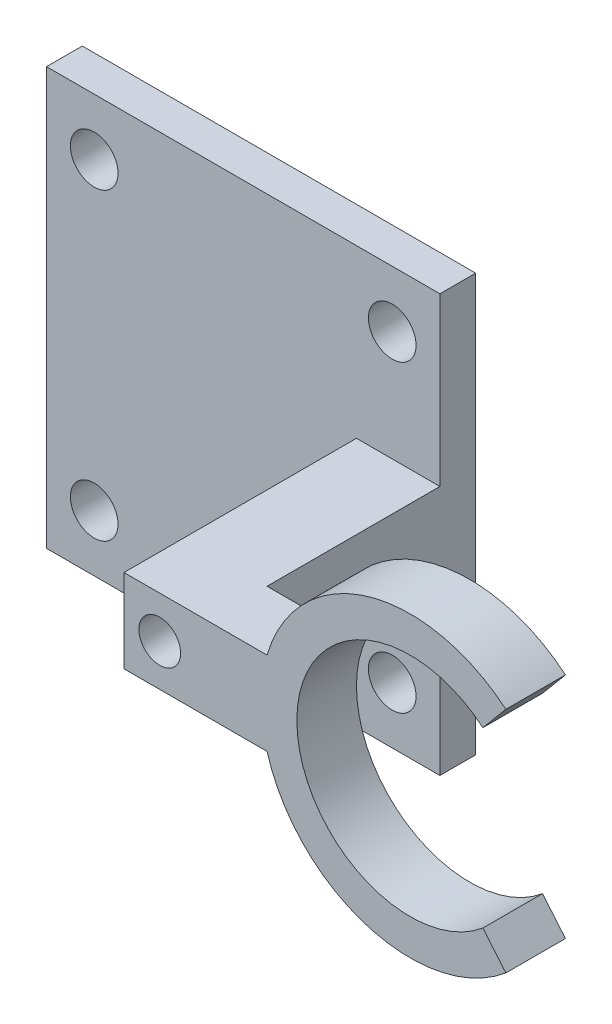
ISO-10303-21;
HEADER;
FILE_DESCRIPTION(('STEP AP214'),'2;1');
FILE_NAME('part.step','',(''),(''),'','','');
FILE_SCHEMA(('AUTOMOTIVE_DESIGN { 1 0 10303 214 1 1 1 1 }'));
ENDSEC;
DATA;
#1=APPLICATION_CONTEXT('core data for automotive mechanical design processes');
#2=APPLICATION_PROTOCOL_DEFINITION('international standard','automotive_design',2000,#1);
#3=PRODUCT_CONTEXT('',#1,'mechanical');
#4=PRODUCT('Part','Part','',(#3));
#5=PRODUCT_RELATED_PRODUCT_CATEGORY('part','',(#4));
#6=PRODUCT_DEFINITION_FORMATION('','',#4);
#7=PRODUCT_DEFINITION_CONTEXT('part definition',#1,'design');
#8=PRODUCT_DEFINITION('design','',#6,#7);
#9=PRODUCT_DEFINITION_SHAPE('','',#8);
#10=(LENGTH_UNIT() NAMED_UNIT(*) SI_UNIT(.MILLI.,.METRE.));
#11=(NAMED_UNIT(*) PLANE_ANGLE_UNIT() SI_UNIT($,.RADIAN.));
#12=(NAMED_UNIT(*) SI_UNIT($,.STERADIAN.) SOLID_ANGLE_UNIT());
#13=UNCERTAINTY_MEASURE_WITH_UNIT(LENGTH_MEASURE(1.E-05),#10,'distance_accuracy_value','');
#14=(GEOMETRIC_REPRESENTATION_CONTEXT(3) GLOBAL_UNCERTAINTY_ASSIGNED_CONTEXT((#13)) GLOBAL_UNIT_ASSIGNED_CONTEXT((#10,
#11,#12)) REPRESENTATION_CONTEXT('',''));
#15=CARTESIAN_POINT('',(0.,0.,0.));
#16=DIRECTION('',(0.,0.,1.));
#17=DIRECTION('',(1.,0.,0.));
#18=AXIS2_PLACEMENT_3D('',#15,#16,#17);
#19=CARTESIAN_POINT('',(0.,3.5,0.));
#20=DIRECTION('',(0.,-1.,0.));
#21=DIRECTION('',(0.,0.,-1.));
#22=AXIS2_PLACEMENT_3D('',#19,#20,#21);
#23=PLANE('',#22);
#24=DIRECTION('',(1.,0.,0.));
#25=VECTOR('',#24,1.);
#26=CARTESIAN_POINT('',(0.,3.5,-17.));
#27=LINE('',#26,#25);
#28=CARTESIAN_POINT('',(-24.,3.5,-17.));
#29=VERTEX_POINT('',#28);
#30=CARTESIAN_POINT('',(-17.,3.5,-17.));
#31=VERTEX_POINT('',#30);
#32=EDGE_CURVE('E233',#29,#31,#27,.T.);
#33=ORIENTED_EDGE('',*,*,#32,.F.);
#34=DIRECTION('',(0.,0.,1.));
#35=VECTOR('',#34,1.);
#36=CARTESIAN_POINT('',(-24.,3.5,2.5));
#37=LINE('',#36,#35);
#38=CARTESIAN_POINT('',(-24.,3.5,2.5));
#39=VERTEX_POINT('',#38);
#40=EDGE_CURVE('E58',#29,#39,#37,.T.);
#41=ORIENTED_EDGE('',*,*,#40,.T.);
#42=DIRECTION('',(1.,0.,0.));
#43=VECTOR('',#42,1.);
#44=CARTESIAN_POINT('',(-12.,3.5,2.5));
#45=LINE('',#44,#43);
#46=CARTESIAN_POINT('',(-12.,3.5,2.5));
#47=VERTEX_POINT('',#46);
#48=EDGE_CURVE('E252',#39,#47,#45,.T.);
#49=ORIENTED_EDGE('',*,*,#48,.T.);
#50=DIRECTION('',(0.,0.,-1.));
#51=VECTOR('',#50,1.);
#52=CARTESIAN_POINT('',(-12.,3.5,-2.5));
#53=LINE('',#52,#51);
#54=CARTESIAN_POINT('',(-12.,3.50000000000001,-2.5));
#55=VERTEX_POINT('',#54);
#56=EDGE_CURVE('E245',#47,#55,#53,.T.);
#57=ORIENTED_EDGE('',*,*,#56,.T.);
#58=DIRECTION('',(-1.,0.,0.));
#59=VECTOR('',#58,1.);
#60=CARTESIAN_POINT('',(-12.,3.5,-2.5));
#61=LINE('',#60,#59);
#62=CARTESIAN_POINT('',(-17.,3.5,-2.5));
#63=VERTEX_POINT('',#62);
#64=EDGE_CURVE('E81',#55,#63,#61,.T.);
#65=ORIENTED_EDGE('',*,*,#64,.T.);
#66=DIRECTION('',(0.,0.,-1.));
#67=VECTOR('',#66,1.);
#68=CARTESIAN_POINT('',(-17.,3.5,-2.5));
#69=LINE('',#68,#67);
#70=EDGE_CURVE('E249',#63,#31,#69,.T.);
#71=ORIENTED_EDGE('',*,*,#70,.T.);
#72=EDGE_LOOP('',(#33,#41,#49,#57,#65,#71));
#73=FACE_BOUND('',#72,.T.);
#74=ADVANCED_FACE('F35',(#73),#23,.F.);
#75=CARTESIAN_POINT('',(0.,-3.5,0.));
#76=DIRECTION('',(0.,-1.,0.));
#77=DIRECTION('',(0.,0.,-1.));
#78=AXIS2_PLACEMENT_3D('',#75,#76,#77);
#79=PLANE('',#78);
#80=DIRECTION('',(0.,0.,1.));
#81=VECTOR('',#80,1.);
#82=CARTESIAN_POINT('',(-24.,-3.5,2.5));
#83=LINE('',#82,#81);
#84=CARTESIAN_POINT('',(-24.,-3.5,-17.));
#85=VERTEX_POINT('',#84);
#86=CARTESIAN_POINT('',(-24.,-3.5,2.5));
#87=VERTEX_POINT('',#86);
#88=EDGE_CURVE('E75',#85,#87,#83,.T.);
#89=ORIENTED_EDGE('',*,*,#88,.F.);
#90=DIRECTION('',(1.,0.,0.));
#91=VECTOR('',#90,1.);
#92=CARTESIAN_POINT('',(0.,-3.5,-17.));
#93=LINE('',#92,#91);
#94=CARTESIAN_POINT('',(-17.,-3.5,-17.));
#95=VERTEX_POINT('',#94);
#96=EDGE_CURVE('E11',#85,#95,#93,.T.);
#97=ORIENTED_EDGE('',*,*,#96,.T.);
#98=DIRECTION('',(0.,0.,-1.));
#99=VECTOR('',#98,1.);
#100=CARTESIAN_POINT('',(-17.,-3.5,-2.5));
#101=LINE('',#100,#99);
#102=CARTESIAN_POINT('',(-17.,-3.5,-2.5));
#103=VERTEX_POINT('',#102);
#104=EDGE_CURVE('E259',#103,#95,#101,.T.);
#105=ORIENTED_EDGE('',*,*,#104,.F.);
#106=DIRECTION('',(-1.,0.,0.));
#107=VECTOR('',#106,1.);
#108=CARTESIAN_POINT('',(-12.,-3.5,-2.5));
#109=LINE('',#108,#107);
#110=CARTESIAN_POINT('',(-12.,-3.5,-2.5));
#111=VERTEX_POINT('',#110);
#112=EDGE_CURVE('E257',#111,#103,#109,.T.);
#113=ORIENTED_EDGE('',*,*,#112,.F.);
#114=DIRECTION('',(0.,0.,-1.));
#115=VECTOR('',#114,1.);
#116=CARTESIAN_POINT('',(-12.,-3.5,-2.5));
#117=LINE('',#116,#115);
#118=CARTESIAN_POINT('',(-12.,-3.5,2.5));
#119=VERTEX_POINT('',#118);
#120=EDGE_CURVE('E244',#119,#111,#117,.T.);
#121=ORIENTED_EDGE('',*,*,#120,.F.);
#122=DIRECTION('',(1.,0.,0.));
#123=VECTOR('',#122,1.);
#124=CARTESIAN_POINT('',(-12.,-3.5,2.5));
#125=LINE('',#124,#123);
#126=EDGE_CURVE('E247',#87,#119,#125,.T.);
#127=ORIENTED_EDGE('',*,*,#126,.F.);
#128=EDGE_LOOP('',(#89,#97,#105,#113,#121,#127));
#129=FACE_BOUND('',#128,.T.);
#130=ADVANCED_FACE('F281',(#129),#79,.T.);
#131=CARTESIAN_POINT('',(-12.,3.5,-2.5));
#132=DIRECTION('',(0.,0.,1.));
#133=DIRECTION('',(1.,0.,0.));
#134=AXIS2_PLACEMENT_3D('',#131,#132,#133);
#135=PLANE('',#134);
#136=ORIENTED_EDGE('',*,*,#64,.F.);
#137=CARTESIAN_POINT('',(0.,0.,-2.5));
#138=DIRECTION('',(0.,0.,1.));
#139=DIRECTION('',(0.642787609686539,0.766044443118978,0.));
#140=AXIS2_PLACEMENT_3D('',#137,#138,#139);
#141=CIRCLE('',#140,12.5);
#142=CARTESIAN_POINT('',(8.03484512108174,9.57555553898723,-2.5));
#143=VERTEX_POINT('',#142);
#144=EDGE_CURVE('E149',#143,#55,#141,.T.);
#145=ORIENTED_EDGE('',*,*,#144,.F.);
#146=DIRECTION('',(0.642787609686539,0.766044443118979,0.));
#147=VECTOR('',#146,1.);
#148=CARTESIAN_POINT('',(6.10648229202213,7.27742220963029,-2.5));
#149=LINE('',#148,#147);
#150=CARTESIAN_POINT('',(6.10648229202213,7.27742220963029,-2.5));
#151=VERTEX_POINT('',#150);
#152=EDGE_CURVE('E157',#151,#143,#149,.T.);
#153=ORIENTED_EDGE('',*,*,#152,.F.);
#154=CARTESIAN_POINT('',(0.,0.,-2.5));
#155=DIRECTION('',(0.,0.,1.));
#156=DIRECTION('',(0.642787609686539,0.766044443118978,0.));
#157=AXIS2_PLACEMENT_3D('',#154,#155,#156);
#158=CIRCLE('',#157,9.5);
#159=CARTESIAN_POINT('',(6.10648229202215,-7.27742220963027,-2.5));
#160=VERTEX_POINT('',#159);
#161=EDGE_CURVE('E181',#151,#160,#158,.T.);
#162=ORIENTED_EDGE('',*,*,#161,.T.);
#163=DIRECTION('',(0.642787609686543,-0.766044443118975,0.));
#164=VECTOR('',#163,1.);
#165=CARTESIAN_POINT('',(6.10648229202215,-7.27742220963027,-2.5));
#166=LINE('',#165,#164);
#167=CARTESIAN_POINT('',(8.03484512108177,-9.5755555389872,-2.5));
#168=VERTEX_POINT('',#167);
#169=EDGE_CURVE('E182',#160,#168,#166,.T.);
#170=ORIENTED_EDGE('',*,*,#169,.T.);
#171=EDGE_CURVE('E163',#111,#168,#141,.T.);
#172=ORIENTED_EDGE('',*,*,#171,.F.);
#173=ORIENTED_EDGE('',*,*,#112,.T.);
#174=DIRECTION('',(0.,-1.,0.));
#175=VECTOR('',#174,1.);
#176=CARTESIAN_POINT('',(-17.,3.5,-2.5));
#177=LINE('',#176,#175);
#178=EDGE_CURVE('E43',#63,#103,#177,.T.);
#179=ORIENTED_EDGE('',*,*,#178,.F.);
#180=EDGE_LOOP('',(#136,#145,#153,#162,#170,#172,#173,#179));
#181=FACE_BOUND('',#180,.T.);
#182=ADVANCED_FACE('F37',(#181),#135,.F.);
#183=CARTESIAN_POINT('',(-17.,3.5,-2.5));
#184=DIRECTION('',(-1.,0.,0.));
#185=DIRECTION('',(0.,0.,1.));
#186=AXIS2_PLACEMENT_3D('',#183,#184,#185);
#187=PLANE('',#186);
#188=DIRECTION('',(0.,-1.,0.));
#189=VECTOR('',#188,1.);
#190=CARTESIAN_POINT('',(-17.,3.5,-20.));
#191=LINE('',#190,#189);
#192=CARTESIAN_POINT('',(-17.,17.5,-20.));
#193=VERTEX_POINT('',#192);
#194=CARTESIAN_POINT('',(-17.,-17.5,-20.));
#195=VERTEX_POINT('',#194);
#196=EDGE_CURVE('E272',#193,#195,#191,.T.);
#197=ORIENTED_EDGE('',*,*,#196,.F.);
#198=DIRECTION('',(0.,0.,-1.));
#199=VECTOR('',#198,1.);
#200=CARTESIAN_POINT('',(-17.,17.5,31.1040538832228));
#201=LINE('',#200,#199);
#202=CARTESIAN_POINT('',(-17.,17.5,-17.));
#203=VERTEX_POINT('',#202);
#204=EDGE_CURVE('E215',#203,#193,#201,.T.);
#205=ORIENTED_EDGE('',*,*,#204,.F.);
#206=DIRECTION('',(0.,1.,0.));
#207=VECTOR('',#206,1.);
#208=CARTESIAN_POINT('',(-17.,0.,-17.));
#209=LINE('',#208,#207);
#210=EDGE_CURVE('E236',#31,#203,#209,.T.);
#211=ORIENTED_EDGE('',*,*,#210,.F.);
#212=ORIENTED_EDGE('',*,*,#70,.F.);
#213=ORIENTED_EDGE('',*,*,#178,.T.);
#214=ORIENTED_EDGE('',*,*,#104,.T.);
#215=CARTESIAN_POINT('',(-17.,-17.5,-17.));
#216=VERTEX_POINT('',#215);
#217=EDGE_CURVE('E50',#216,#95,#209,.T.);
#218=ORIENTED_EDGE('',*,*,#217,.F.);
#219=DIRECTION('',(0.,0.,-1.));
#220=VECTOR('',#219,1.);
#221=CARTESIAN_POINT('',(-17.,-17.5,31.1040538832228));
#222=LINE('',#221,#220);
#223=EDGE_CURVE('E218',#216,#195,#222,.T.);
#224=ORIENTED_EDGE('',*,*,#223,.T.);
#225=EDGE_LOOP('',(#197,#205,#211,#212,#213,#214,#218,#224));
#226=FACE_BOUND('',#225,.T.);
#227=ADVANCED_FACE('F277',(#226),#187,.F.);
#228=CARTESIAN_POINT('',(-50.,3.5,-20.));
#229=DIRECTION('',(0.,0.,1.));
#230=DIRECTION('',(1.,0.,0.));
#231=AXIS2_PLACEMENT_3D('',#228,#229,#230);
#232=PLANE('',#231);
#233=CARTESIAN_POINT('',(-21.,0.,-20.));
#234=DIRECTION('',(0.,0.,1.));
#235=DIRECTION('',(1.,0.,0.));
#236=AXIS2_PLACEMENT_3D('',#233,#234,#235);
#237=CIRCLE('',#236,1.75);
#238=CARTESIAN_POINT('',(-19.25,0.,-20.));
#239=VERTEX_POINT('',#238);
#240=EDGE_CURVE('E187',#239,#239,#237,.T.);
#241=ORIENTED_EDGE('',*,*,#240,.T.);
#242=EDGE_LOOP('',(#241));
#243=FACE_BOUND('',#242,.T.);
#244=ORIENTED_EDGE('',*,*,#196,.T.);
#245=DIRECTION('',(-1.,0.,0.));
#246=VECTOR('',#245,1.);
#247=CARTESIAN_POINT('',(0.,-17.5,-20.));
#248=LINE('',#247,#246);
#249=CARTESIAN_POINT('',(-50.,-17.5,-20.));
#250=VERTEX_POINT('',#249);
#251=EDGE_CURVE('E205',#195,#250,#248,.T.);
#252=ORIENTED_EDGE('',*,*,#251,.T.);
#253=DIRECTION('',(0.,-1.,0.));
#254=VECTOR('',#253,1.);
#255=CARTESIAN_POINT('',(-50.,3.5,-20.));
#256=LINE('',#255,#254);
#257=CARTESIAN_POINT('',(-50.,17.5,-20.));
#258=VERTEX_POINT('',#257);
#259=EDGE_CURVE('E270',#258,#250,#256,.T.);
#260=ORIENTED_EDGE('',*,*,#259,.F.);
#261=DIRECTION('',(-1.,0.,0.));
#262=VECTOR('',#261,1.);
#263=CARTESIAN_POINT('',(0.,17.5,-20.));
#264=LINE('',#263,#262);
#265=EDGE_CURVE('E212',#193,#258,#264,.T.);
#266=ORIENTED_EDGE('',*,*,#265,.F.);
#267=EDGE_LOOP('',(#244,#252,#260,#266));
#268=FACE_BOUND('',#267,.T.);
#269=CARTESIAN_POINT('',(-21.,-12.75,-20.));
#270=DIRECTION('',(0.,0.,-1.));
#271=DIRECTION('',(-1.,0.,0.));
#272=AXIS2_PLACEMENT_3D('',#269,#270,#271);
#273=CIRCLE('',#272,2.);
#274=CARTESIAN_POINT('',(-23.,-12.75,-20.));
#275=VERTEX_POINT('',#274);
#276=EDGE_CURVE('E206',#275,#275,#273,.T.);
#277=ORIENTED_EDGE('',*,*,#276,.F.);
#278=EDGE_LOOP('',(#277));
#279=FACE_BOUND('',#278,.T.);
#280=CARTESIAN_POINT('',(-46.,-12.75,-20.));
#281=DIRECTION('',(0.,0.,-1.));
#282=DIRECTION('',(-1.,0.,0.));
#283=AXIS2_PLACEMENT_3D('',#280,#281,#282);
#284=CIRCLE('',#283,2.);
#285=CARTESIAN_POINT('',(-48.,-12.75,-20.));
#286=VERTEX_POINT('',#285);
#287=EDGE_CURVE('E197',#286,#286,#284,.F.);
#288=ORIENTED_EDGE('',*,*,#287,.T.);
#289=EDGE_LOOP('',(#288));
#290=FACE_BOUND('',#289,.T.);
#291=CARTESIAN_POINT('',(-21.,12.75,-20.));
#292=DIRECTION('',(0.,0.,-1.));
#293=DIRECTION('',(-1.,0.,0.));
#294=AXIS2_PLACEMENT_3D('',#291,#292,#293);
#295=CIRCLE('',#294,2.);
#296=CARTESIAN_POINT('',(-23.,12.75,-20.));
#297=VERTEX_POINT('',#296);
#298=EDGE_CURVE('E198',#297,#297,#295,.T.);
#299=ORIENTED_EDGE('',*,*,#298,.F.);
#300=EDGE_LOOP('',(#299));
#301=FACE_BOUND('',#300,.T.);
#302=CARTESIAN_POINT('',(-46.,12.75,-20.));
#303=DIRECTION('',(0.,0.,-1.));
#304=DIRECTION('',(-1.,0.,0.));
#305=AXIS2_PLACEMENT_3D('',#302,#303,#304);
#306=CIRCLE('',#305,2.);
#307=CARTESIAN_POINT('',(-48.,12.75,-20.));
#308=VERTEX_POINT('',#307);
#309=EDGE_CURVE('E193',#308,#308,#306,.F.);
#310=ORIENTED_EDGE('',*,*,#309,.T.);
#311=EDGE_LOOP('',(#310));
#312=FACE_BOUND('',#311,.T.);
#313=ADVANCED_FACE('F312',(#243,#268,#279,#290,#301,#312),#232,.F.);
#314=CARTESIAN_POINT('',(-50.,3.5,-17.));
#315=DIRECTION('',(1.,0.,0.));
#316=DIRECTION('',(0.,0.,-1.));
#317=AXIS2_PLACEMENT_3D('',#314,#315,#316);
#318=PLANE('',#317);
#319=ORIENTED_EDGE('',*,*,#259,.T.);
#320=DIRECTION('',(0.,0.,-1.));
#321=VECTOR('',#320,1.);
#322=CARTESIAN_POINT('',(-50.,-17.5,31.1040538832228));
#323=LINE('',#322,#321);
#324=CARTESIAN_POINT('',(-50.,-17.5,-17.));
#325=VERTEX_POINT('',#324);
#326=EDGE_CURVE('E221',#325,#250,#323,.T.);
#327=ORIENTED_EDGE('',*,*,#326,.F.);
#328=DIRECTION('',(0.,-1.,0.));
#329=VECTOR('',#328,1.);
#330=CARTESIAN_POINT('',(-50.,3.5,-17.));
#331=LINE('',#330,#329);
#332=CARTESIAN_POINT('',(-50.,17.5,-17.));
#333=VERTEX_POINT('',#332);
#334=EDGE_CURVE('E268',#333,#325,#331,.T.);
#335=ORIENTED_EDGE('',*,*,#334,.F.);
#336=DIRECTION('',(0.,0.,-1.));
#337=VECTOR('',#336,1.);
#338=CARTESIAN_POINT('',(-50.,17.5,31.1040538832228));
#339=LINE('',#338,#337);
#340=EDGE_CURVE('E190',#333,#258,#339,.T.);
#341=ORIENTED_EDGE('',*,*,#340,.T.);
#342=EDGE_LOOP('',(#319,#327,#335,#341));
#343=FACE_BOUND('',#342,.T.);
#344=ADVANCED_FACE('F309',(#343),#318,.F.);
#345=CARTESIAN_POINT('',(-24.,3.5,-17.));
#346=DIRECTION('',(0.,0.,-1.));
#347=DIRECTION('',(-1.,0.,0.));
#348=AXIS2_PLACEMENT_3D('',#345,#346,#347);
#349=PLANE('',#348);
#350=ORIENTED_EDGE('',*,*,#334,.T.);
#351=DIRECTION('',(1.,0.,0.));
#352=VECTOR('',#351,1.);
#353=CARTESIAN_POINT('',(0.,-17.5,-17.));
#354=LINE('',#353,#352);
#355=EDGE_CURVE('E234',#325,#216,#354,.T.);
#356=ORIENTED_EDGE('',*,*,#355,.T.);
#357=ORIENTED_EDGE('',*,*,#217,.T.);
#358=ORIENTED_EDGE('',*,*,#96,.F.);
#359=DIRECTION('',(0.,-1.,0.));
#360=VECTOR('',#359,1.);
#361=CARTESIAN_POINT('',(-24.,3.5,-17.));
#362=LINE('',#361,#360);
#363=EDGE_CURVE('E266',#29,#85,#362,.T.);
#364=ORIENTED_EDGE('',*,*,#363,.F.);
#365=ORIENTED_EDGE('',*,*,#32,.T.);
#366=ORIENTED_EDGE('',*,*,#210,.T.);
#367=DIRECTION('',(1.,0.,0.));
#368=VECTOR('',#367,1.);
#369=CARTESIAN_POINT('',(0.,17.5,-17.));
#370=LINE('',#369,#368);
#371=EDGE_CURVE('E209',#333,#203,#370,.T.);
#372=ORIENTED_EDGE('',*,*,#371,.F.);
#373=EDGE_LOOP('',(#350,#356,#357,#358,#364,#365,#366,#372));
#374=FACE_BOUND('',#373,.T.);
#375=CARTESIAN_POINT('',(-21.,-12.75,-17.));
#376=DIRECTION('',(0.,0.,-1.));
#377=DIRECTION('',(-1.,0.,0.));
#378=AXIS2_PLACEMENT_3D('',#375,#376,#377);
#379=CIRCLE('',#378,2.);
#380=CARTESIAN_POINT('',(-23.,-12.75,-17.));
#381=VERTEX_POINT('',#380);
#382=EDGE_CURVE('E201',#381,#381,#379,.F.);
#383=ORIENTED_EDGE('',*,*,#382,.F.);
#384=EDGE_LOOP('',(#383));
#385=FACE_BOUND('',#384,.T.);
#386=CARTESIAN_POINT('',(-46.,-12.75,-17.));
#387=DIRECTION('',(0.,0.,-1.));
#388=DIRECTION('',(-1.,0.,0.));
#389=AXIS2_PLACEMENT_3D('',#386,#387,#388);
#390=CIRCLE('',#389,2.);
#391=CARTESIAN_POINT('',(-48.,-12.75,-17.));
#392=VERTEX_POINT('',#391);
#393=EDGE_CURVE('E230',#392,#392,#390,.T.);
#394=ORIENTED_EDGE('',*,*,#393,.T.);
#395=EDGE_LOOP('',(#394));
#396=FACE_BOUND('',#395,.T.);
#397=CARTESIAN_POINT('',(-21.,12.75,-17.));
#398=DIRECTION('',(0.,0.,-1.));
#399=DIRECTION('',(-1.,0.,0.));
#400=AXIS2_PLACEMENT_3D('',#397,#398,#399);
#401=CIRCLE('',#400,2.);
#402=CARTESIAN_POINT('',(-23.,12.75,-17.));
#403=VERTEX_POINT('',#402);
#404=EDGE_CURVE('E202',#403,#403,#401,.F.);
#405=ORIENTED_EDGE('',*,*,#404,.F.);
#406=EDGE_LOOP('',(#405));
#407=FACE_BOUND('',#406,.T.);
#408=CARTESIAN_POINT('',(-46.,12.75,-17.));
#409=DIRECTION('',(0.,0.,-1.));
#410=DIRECTION('',(-1.,0.,0.));
#411=AXIS2_PLACEMENT_3D('',#408,#409,#410);
#412=CIRCLE('',#411,2.);
#413=CARTESIAN_POINT('',(-48.,12.75,-17.));
#414=VERTEX_POINT('',#413);
#415=EDGE_CURVE('E196',#414,#414,#412,.T.);
#416=ORIENTED_EDGE('',*,*,#415,.T.);
#417=EDGE_LOOP('',(#416));
#418=FACE_BOUND('',#417,.T.);
#419=ADVANCED_FACE('F285',(#374,#385,#396,#407,#418),#349,.F.);
#420=CARTESIAN_POINT('',(-24.,3.5,2.5));
#421=DIRECTION('',(1.,0.,0.));
#422=DIRECTION('',(0.,0.,-1.));
#423=AXIS2_PLACEMENT_3D('',#420,#421,#422);
#424=PLANE('',#423);
#425=ORIENTED_EDGE('',*,*,#88,.T.);
#426=DIRECTION('',(0.,-1.,0.));
#427=VECTOR('',#426,1.);
#428=CARTESIAN_POINT('',(-24.,3.5,2.5));
#429=LINE('',#428,#427);
#430=EDGE_CURVE('E254',#39,#87,#429,.T.);
#431=ORIENTED_EDGE('',*,*,#430,.F.);
#432=ORIENTED_EDGE('',*,*,#40,.F.);
#433=ORIENTED_EDGE('',*,*,#363,.T.);
#434=EDGE_LOOP('',(#425,#431,#432,#433));
#435=FACE_BOUND('',#434,.T.);
#436=ADVANCED_FACE('F287',(#435),#424,.F.);
#437=CARTESIAN_POINT('',(-12.,3.5,2.5));
#438=DIRECTION('',(0.,0.,-1.));
#439=DIRECTION('',(-1.,0.,0.));
#440=AXIS2_PLACEMENT_3D('',#437,#438,#439);
#441=PLANE('',#440);
#442=ORIENTED_EDGE('',*,*,#126,.T.);
#443=CARTESIAN_POINT('',(0.,0.,2.5));
#444=DIRECTION('',(0.,0.,1.));
#445=DIRECTION('',(0.642787609686541,0.766044443118977,0.));
#446=AXIS2_PLACEMENT_3D('',#443,#444,#445);
#447=CIRCLE('',#446,12.5);
#448=CARTESIAN_POINT('',(8.03484512108176,-9.57555553898721,2.5));
#449=VERTEX_POINT('',#448);
#450=EDGE_CURVE('E168',#119,#449,#447,.T.);
#451=ORIENTED_EDGE('',*,*,#450,.T.);
#452=DIRECTION('',(-0.642787609686541,0.766044443118977,0.));
#453=VECTOR('',#452,1.);
#454=CARTESIAN_POINT('',(8.03484512108176,-9.57555553898721,2.5));
#455=LINE('',#454,#453);
#456=CARTESIAN_POINT('',(6.10648229202213,-7.27742220963028,2.5));
#457=VERTEX_POINT('',#456);
#458=EDGE_CURVE('E173',#449,#457,#455,.T.);
#459=ORIENTED_EDGE('',*,*,#458,.T.);
#460=CARTESIAN_POINT('',(0.,0.,2.5));
#461=DIRECTION('',(0.,0.,1.));
#462=DIRECTION('',(0.642787609686541,0.766044443118977,0.));
#463=AXIS2_PLACEMENT_3D('',#460,#461,#462);
#464=CIRCLE('',#463,9.5);
#465=CARTESIAN_POINT('',(6.10648229202214,7.27742220963028,2.5));
#466=VERTEX_POINT('',#465);
#467=EDGE_CURVE('E175',#466,#457,#464,.T.);
#468=ORIENTED_EDGE('',*,*,#467,.F.);
#469=DIRECTION('',(-0.642787609686541,-0.766044443118977,0.));
#470=VECTOR('',#469,1.);
#471=CARTESIAN_POINT('',(8.03484512108176,9.57555553898721,2.5));
#472=LINE('',#471,#470);
#473=CARTESIAN_POINT('',(8.03484512108176,9.57555553898721,2.5));
#474=VERTEX_POINT('',#473);
#475=EDGE_CURVE('E154',#474,#466,#472,.T.);
#476=ORIENTED_EDGE('',*,*,#475,.F.);
#477=EDGE_CURVE('E151',#474,#47,#447,.T.);
#478=ORIENTED_EDGE('',*,*,#477,.T.);
#479=ORIENTED_EDGE('',*,*,#48,.F.);
#480=ORIENTED_EDGE('',*,*,#430,.T.);
#481=EDGE_LOOP('',(#442,#451,#459,#468,#476,#478,#479,#480));
#482=FACE_BOUND('',#481,.T.);
#483=CARTESIAN_POINT('',(-21.,0.,2.5));
#484=DIRECTION('',(0.,0.,1.));
#485=DIRECTION('',(1.,0.,0.));
#486=AXIS2_PLACEMENT_3D('',#483,#484,#485);
#487=CIRCLE('',#486,1.75);
#488=CARTESIAN_POINT('',(-19.25,0.,2.5));
#489=VERTEX_POINT('',#488);
#490=EDGE_CURVE('E186',#489,#489,#487,.T.);
#491=ORIENTED_EDGE('',*,*,#490,.F.);
#492=EDGE_LOOP('',(#491));
#493=FACE_BOUND('',#492,.T.);
#494=ADVANCED_FACE('F290',(#482,#493),#441,.F.);
#495=CARTESIAN_POINT('',(-46.,-12.75,31.1040538832228));
#496=DIRECTION('',(0.,0.,-1.));
#497=DIRECTION('',(-1.,0.,0.));
#498=AXIS2_PLACEMENT_3D('',#495,#496,#497);
#499=CYLINDRICAL_SURFACE('',#498,2.);
#500=CARTESIAN_POINT('',(-48.,-12.75,-17.));
#501=CARTESIAN_POINT('',(-48.,-12.75,-17.03125));
#502=CARTESIAN_POINT('',(-48.,-12.75,-17.0625));
#503=CARTESIAN_POINT('',(-48.,-12.75,-17.125));
#504=CARTESIAN_POINT('',(-48.,-12.75,-17.15625));
#505=CARTESIAN_POINT('',(-48.,-12.75,-17.21875));
#506=CARTESIAN_POINT('',(-48.,-12.75,-17.25));
#507=CARTESIAN_POINT('',(-48.,-12.75,-17.3125));
#508=CARTESIAN_POINT('',(-48.,-12.75,-17.34375));
#509=CARTESIAN_POINT('',(-48.,-12.75,-17.40625));
#510=CARTESIAN_POINT('',(-48.,-12.75,-17.4375));
#511=CARTESIAN_POINT('',(-48.,-12.75,-17.5));
#512=CARTESIAN_POINT('',(-48.,-12.75,-17.53125));
#513=CARTESIAN_POINT('',(-48.,-12.75,-17.59375));
#514=CARTESIAN_POINT('',(-48.,-12.75,-17.625));
#515=CARTESIAN_POINT('',(-48.,-12.75,-17.6875));
#516=CARTESIAN_POINT('',(-48.,-12.75,-17.71875));
#517=CARTESIAN_POINT('',(-48.,-12.75,-17.78125));
#518=CARTESIAN_POINT('',(-48.,-12.75,-17.8125));
#519=CARTESIAN_POINT('',(-48.,-12.75,-17.875));
#520=CARTESIAN_POINT('',(-48.,-12.75,-17.90625));
#521=CARTESIAN_POINT('',(-48.,-12.75,-17.96875));
#522=CARTESIAN_POINT('',(-48.,-12.75,-18.));
#523=CARTESIAN_POINT('',(-48.,-12.75,-18.0625));
#524=CARTESIAN_POINT('',(-48.,-12.75,-18.09375));
#525=CARTESIAN_POINT('',(-48.,-12.75,-18.15625));
#526=CARTESIAN_POINT('',(-48.,-12.75,-18.1875));
#527=CARTESIAN_POINT('',(-48.,-12.75,-18.25));
#528=CARTESIAN_POINT('',(-48.,-12.75,-18.28125));
#529=CARTESIAN_POINT('',(-48.,-12.75,-18.34375));
#530=CARTESIAN_POINT('',(-48.,-12.75,-18.375));
#531=CARTESIAN_POINT('',(-48.,-12.75,-18.4375));
#532=CARTESIAN_POINT('',(-48.,-12.75,-18.46875));
#533=CARTESIAN_POINT('',(-48.,-12.75,-18.53125));
#534=CARTESIAN_POINT('',(-48.,-12.75,-18.5625));
#535=CARTESIAN_POINT('',(-48.,-12.75,-18.625));
#536=CARTESIAN_POINT('',(-48.,-12.75,-18.65625));
#537=CARTESIAN_POINT('',(-48.,-12.75,-18.71875));
#538=CARTESIAN_POINT('',(-48.,-12.75,-18.75));
#539=CARTESIAN_POINT('',(-48.,-12.75,-18.8125));
#540=CARTESIAN_POINT('',(-48.,-12.75,-18.84375));
#541=CARTESIAN_POINT('',(-48.,-12.75,-18.90625));
#542=CARTESIAN_POINT('',(-48.,-12.75,-18.9375));
#543=CARTESIAN_POINT('',(-48.,-12.75,-19.));
#544=CARTESIAN_POINT('',(-48.,-12.75,-19.03125));
#545=CARTESIAN_POINT('',(-48.,-12.75,-19.09375));
#546=CARTESIAN_POINT('',(-48.,-12.75,-19.125));
#547=CARTESIAN_POINT('',(-48.,-12.75,-19.1875));
#548=CARTESIAN_POINT('',(-48.,-12.75,-19.21875));
#549=CARTESIAN_POINT('',(-48.,-12.75,-19.28125));
#550=CARTESIAN_POINT('',(-48.,-12.75,-19.3125));
#551=CARTESIAN_POINT('',(-48.,-12.75,-19.375));
#552=CARTESIAN_POINT('',(-48.,-12.75,-19.40625));
#553=CARTESIAN_POINT('',(-48.,-12.75,-19.46875));
#554=CARTESIAN_POINT('',(-48.,-12.75,-19.5));
#555=CARTESIAN_POINT('',(-48.,-12.75,-19.5625));
#556=CARTESIAN_POINT('',(-48.,-12.75,-19.59375));
#557=CARTESIAN_POINT('',(-48.,-12.75,-19.65625));
#558=CARTESIAN_POINT('',(-48.,-12.75,-19.6875));
#559=CARTESIAN_POINT('',(-48.,-12.75,-19.75));
#560=CARTESIAN_POINT('',(-48.,-12.75,-19.78125));
#561=CARTESIAN_POINT('',(-48.,-12.75,-19.84375));
#562=CARTESIAN_POINT('',(-48.,-12.75,-19.875));
#563=CARTESIAN_POINT('',(-48.,-12.75,-19.9375));
#564=CARTESIAN_POINT('',(-48.,-12.75,-19.96875));
#565=CARTESIAN_POINT('',(-48.,-12.75,-20.));
#566=B_SPLINE_CURVE_WITH_KNOTS('',3,(#500,#501,#502,#503,#504,#505,#506,#507,#508,#509,#510,
#511,#512,#513,#514,#515,#516,#517,#518,#519,#520,#521,#522,#523,#524,#525,#526,#527,#528,#529,
#530,#531,#532,#533,#534,#535,#536,#537,#538,#539,#540,#541,#542,#543,#544,#545,#546,#547,#548,
#549,#550,#551,#552,#553,#554,#555,#556,#557,#558,#559,#560,#561,#562,#563,#564,#565),
.UNSPECIFIED.,.F.,.F.,(4,2,2,2,2,2,2,2,2,2,2,2,2,2,2,2,2,2,2,2,2,2,2,2,2,2,2,2,2,2,2,2,4),(0.,
0.0937500000000036,0.1875,0.281249999999997,0.375,0.468750000000004,0.5625,0.656249999999997,
0.750000000000001,0.843750000000004,0.937500000000001,1.03125,1.125,1.21875,1.3125,1.40625,1.5,
1.59375,1.6875,1.78125,1.875,1.96875000000001,2.0625,2.15625,2.25,2.34375000000001,2.4375,
2.53125,2.625,2.71875000000001,2.8125,2.90625,3.),.UNSPECIFIED.);
#567=EDGE_CURVE('BSEAM304',#392,#286,#566,.T.);
#568=ORIENTED_EDGE('',*,*,#393,.F.);
#569=ORIENTED_EDGE('',*,*,#287,.F.);
#570=ORIENTED_EDGE('',*,*,#567,.T.);
#571=ORIENTED_EDGE('',*,*,#567,.F.);
#572=EDGE_LOOP('',(#568,#570,#569,#571));
#573=FACE_BOUND('',#572,.T.);
#574=ADVANCED_FACE('F304',(#573),#499,.F.);
#575=CARTESIAN_POINT('',(-21.,-12.75,31.1040538832228));
#576=DIRECTION('',(0.,0.,-1.));
#577=DIRECTION('',(-1.,0.,0.));
#578=AXIS2_PLACEMENT_3D('',#575,#576,#577);
#579=CYLINDRICAL_SURFACE('',#578,2.);
#580=CARTESIAN_POINT('',(-23.,-12.75,-17.));
#581=CARTESIAN_POINT('',(-23.,-12.75,-17.03125));
#582=CARTESIAN_POINT('',(-23.,-12.75,-17.0625));
#583=CARTESIAN_POINT('',(-23.,-12.75,-17.125));
#584=CARTESIAN_POINT('',(-23.,-12.75,-17.15625));
#585=CARTESIAN_POINT('',(-23.,-12.75,-17.21875));
#586=CARTESIAN_POINT('',(-23.,-12.75,-17.25));
#587=CARTESIAN_POINT('',(-23.,-12.75,-17.3125));
#588=CARTESIAN_POINT('',(-23.,-12.75,-17.34375));
#589=CARTESIAN_POINT('',(-23.,-12.75,-17.40625));
#590=CARTESIAN_POINT('',(-23.,-12.75,-17.4375));
#591=CARTESIAN_POINT('',(-23.,-12.75,-17.5));
#592=CARTESIAN_POINT('',(-23.,-12.75,-17.53125));
#593=CARTESIAN_POINT('',(-23.,-12.75,-17.59375));
#594=CARTESIAN_POINT('',(-23.,-12.75,-17.625));
#595=CARTESIAN_POINT('',(-23.,-12.75,-17.6875));
#596=CARTESIAN_POINT('',(-23.,-12.75,-17.71875));
#597=CARTESIAN_POINT('',(-23.,-12.75,-17.78125));
#598=CARTESIAN_POINT('',(-23.,-12.75,-17.8125));
#599=CARTESIAN_POINT('',(-23.,-12.75,-17.875));
#600=CARTESIAN_POINT('',(-23.,-12.75,-17.90625));
#601=CARTESIAN_POINT('',(-23.,-12.75,-17.96875));
#602=CARTESIAN_POINT('',(-23.,-12.75,-18.));
#603=CARTESIAN_POINT('',(-23.,-12.75,-18.0625));
#604=CARTESIAN_POINT('',(-23.,-12.75,-18.09375));
#605=CARTESIAN_POINT('',(-23.,-12.75,-18.15625));
#606=CARTESIAN_POINT('',(-23.,-12.75,-18.1875));
#607=CARTESIAN_POINT('',(-23.,-12.75,-18.25));
#608=CARTESIAN_POINT('',(-23.,-12.75,-18.28125));
#609=CARTESIAN_POINT('',(-23.,-12.75,-18.34375));
#610=CARTESIAN_POINT('',(-23.,-12.75,-18.375));
#611=CARTESIAN_POINT('',(-23.,-12.75,-18.4375));
#612=CARTESIAN_POINT('',(-23.,-12.75,-18.46875));
#613=CARTESIAN_POINT('',(-23.,-12.75,-18.53125));
#614=CARTESIAN_POINT('',(-23.,-12.75,-18.5625));
#615=CARTESIAN_POINT('',(-23.,-12.75,-18.625));
#616=CARTESIAN_POINT('',(-23.,-12.75,-18.65625));
#617=CARTESIAN_POINT('',(-23.,-12.75,-18.71875));
#618=CARTESIAN_POINT('',(-23.,-12.75,-18.75));
#619=CARTESIAN_POINT('',(-23.,-12.75,-18.8125));
#620=CARTESIAN_POINT('',(-23.,-12.75,-18.84375));
#621=CARTESIAN_POINT('',(-23.,-12.75,-18.90625));
#622=CARTESIAN_POINT('',(-23.,-12.75,-18.9375));
#623=CARTESIAN_POINT('',(-23.,-12.75,-19.));
#624=CARTESIAN_POINT('',(-23.,-12.75,-19.03125));
#625=CARTESIAN_POINT('',(-23.,-12.75,-19.09375));
#626=CARTESIAN_POINT('',(-23.,-12.75,-19.125));
#627=CARTESIAN_POINT('',(-23.,-12.75,-19.1875));
#628=CARTESIAN_POINT('',(-23.,-12.75,-19.21875));
#629=CARTESIAN_POINT('',(-23.,-12.75,-19.28125));
#630=CARTESIAN_POINT('',(-23.,-12.75,-19.3125));
#631=CARTESIAN_POINT('',(-23.,-12.75,-19.375));
#632=CARTESIAN_POINT('',(-23.,-12.75,-19.40625));
#633=CARTESIAN_POINT('',(-23.,-12.75,-19.46875));
#634=CARTESIAN_POINT('',(-23.,-12.75,-19.5));
#635=CARTESIAN_POINT('',(-23.,-12.75,-19.5625));
#636=CARTESIAN_POINT('',(-23.,-12.75,-19.59375));
#637=CARTESIAN_POINT('',(-23.,-12.75,-19.65625));
#638=CARTESIAN_POINT('',(-23.,-12.75,-19.6875));
#639=CARTESIAN_POINT('',(-23.,-12.75,-19.75));
#640=CARTESIAN_POINT('',(-23.,-12.75,-19.78125));
#641=CARTESIAN_POINT('',(-23.,-12.75,-19.84375));
#642=CARTESIAN_POINT('',(-23.,-12.75,-19.875));
#643=CARTESIAN_POINT('',(-23.,-12.75,-19.9375));
#644=CARTESIAN_POINT('',(-23.,-12.75,-19.96875));
#645=CARTESIAN_POINT('',(-23.,-12.75,-20.));
#646=B_SPLINE_CURVE_WITH_KNOTS('',3,(#580,#581,#582,#583,#584,#585,#586,#587,#588,#589,#590,
#591,#592,#593,#594,#595,#596,#597,#598,#599,#600,#601,#602,#603,#604,#605,#606,#607,#608,#609,
#610,#611,#612,#613,#614,#615,#616,#617,#618,#619,#620,#621,#622,#623,#624,#625,#626,#627,#628,
#629,#630,#631,#632,#633,#634,#635,#636,#637,#638,#639,#640,#641,#642,#643,#644,#645),
.UNSPECIFIED.,.F.,.F.,(4,2,2,2,2,2,2,2,2,2,2,2,2,2,2,2,2,2,2,2,2,2,2,2,2,2,2,2,2,2,2,2,4),(0.,
0.0937500000000036,0.1875,0.281249999999997,0.375,0.468750000000004,0.5625,0.656249999999997,
0.750000000000001,0.843750000000004,0.937500000000001,1.03125,1.125,1.21875,1.3125,1.40625,1.5,
1.59375,1.6875,1.78125,1.875,1.96875000000001,2.0625,2.15625,2.25,2.34375000000001,2.4375,
2.53125,2.625,2.71875000000001,2.8125,2.90625,3.),.UNSPECIFIED.);
#647=EDGE_CURVE('BSEAM391',#381,#275,#646,.T.);
#648=ORIENTED_EDGE('',*,*,#382,.T.);
#649=ORIENTED_EDGE('',*,*,#276,.T.);
#650=ORIENTED_EDGE('',*,*,#647,.T.);
#651=ORIENTED_EDGE('',*,*,#647,.F.);
#652=EDGE_LOOP('',(#648,#650,#649,#651));
#653=FACE_BOUND('',#652,.T.);
#654=ADVANCED_FACE('F391',(#653),#579,.F.);
#655=CARTESIAN_POINT('',(0.,-17.5,31.1040538832228));
#656=DIRECTION('',(0.,-1.,0.));
#657=DIRECTION('',(0.,0.,-1.));
#658=AXIS2_PLACEMENT_3D('',#655,#656,#657);
#659=PLANE('',#658);
#660=ORIENTED_EDGE('',*,*,#355,.F.);
#661=ORIENTED_EDGE('',*,*,#326,.T.);
#662=ORIENTED_EDGE('',*,*,#251,.F.);
#663=ORIENTED_EDGE('',*,*,#223,.F.);
#664=EDGE_LOOP('',(#660,#661,#662,#663));
#665=FACE_BOUND('',#664,.T.);
#666=ADVANCED_FACE('F381',(#665),#659,.T.);
#667=CARTESIAN_POINT('',(-21.,12.75,31.1040538832228));
#668=DIRECTION('',(0.,0.,-1.));
#669=DIRECTION('',(-1.,0.,0.));
#670=AXIS2_PLACEMENT_3D('',#667,#668,#669);
#671=CYLINDRICAL_SURFACE('',#670,2.);
#672=CARTESIAN_POINT('',(-23.,12.75,-17.));
#673=CARTESIAN_POINT('',(-23.,12.75,-17.03125));
#674=CARTESIAN_POINT('',(-23.,12.75,-17.0625));
#675=CARTESIAN_POINT('',(-23.,12.75,-17.125));
#676=CARTESIAN_POINT('',(-23.,12.75,-17.15625));
#677=CARTESIAN_POINT('',(-23.,12.75,-17.21875));
#678=CARTESIAN_POINT('',(-23.,12.75,-17.25));
#679=CARTESIAN_POINT('',(-23.,12.75,-17.3125));
#680=CARTESIAN_POINT('',(-23.,12.75,-17.34375));
#681=CARTESIAN_POINT('',(-23.,12.75,-17.40625));
#682=CARTESIAN_POINT('',(-23.,12.75,-17.4375));
#683=CARTESIAN_POINT('',(-23.,12.75,-17.5));
#684=CARTESIAN_POINT('',(-23.,12.75,-17.53125));
#685=CARTESIAN_POINT('',(-23.,12.75,-17.59375));
#686=CARTESIAN_POINT('',(-23.,12.75,-17.625));
#687=CARTESIAN_POINT('',(-23.,12.75,-17.6875));
#688=CARTESIAN_POINT('',(-23.,12.75,-17.71875));
#689=CARTESIAN_POINT('',(-23.,12.75,-17.78125));
#690=CARTESIAN_POINT('',(-23.,12.75,-17.8125));
#691=CARTESIAN_POINT('',(-23.,12.75,-17.875));
#692=CARTESIAN_POINT('',(-23.,12.75,-17.90625));
#693=CARTESIAN_POINT('',(-23.,12.75,-17.96875));
#694=CARTESIAN_POINT('',(-23.,12.75,-18.));
#695=CARTESIAN_POINT('',(-23.,12.75,-18.0625));
#696=CARTESIAN_POINT('',(-23.,12.75,-18.09375));
#697=CARTESIAN_POINT('',(-23.,12.75,-18.15625));
#698=CARTESIAN_POINT('',(-23.,12.75,-18.1875));
#699=CARTESIAN_POINT('',(-23.,12.75,-18.25));
#700=CARTESIAN_POINT('',(-23.,12.75,-18.28125));
#701=CARTESIAN_POINT('',(-23.,12.75,-18.34375));
#702=CARTESIAN_POINT('',(-23.,12.75,-18.375));
#703=CARTESIAN_POINT('',(-23.,12.75,-18.4375));
#704=CARTESIAN_POINT('',(-23.,12.75,-18.46875));
#705=CARTESIAN_POINT('',(-23.,12.75,-18.53125));
#706=CARTESIAN_POINT('',(-23.,12.75,-18.5625));
#707=CARTESIAN_POINT('',(-23.,12.75,-18.625));
#708=CARTESIAN_POINT('',(-23.,12.75,-18.65625));
#709=CARTESIAN_POINT('',(-23.,12.75,-18.71875));
#710=CARTESIAN_POINT('',(-23.,12.75,-18.75));
#711=CARTESIAN_POINT('',(-23.,12.75,-18.8125));
#712=CARTESIAN_POINT('',(-23.,12.75,-18.84375));
#713=CARTESIAN_POINT('',(-23.,12.75,-18.90625));
#714=CARTESIAN_POINT('',(-23.,12.75,-18.9375));
#715=CARTESIAN_POINT('',(-23.,12.75,-19.));
#716=CARTESIAN_POINT('',(-23.,12.75,-19.03125));
#717=CARTESIAN_POINT('',(-23.,12.75,-19.09375));
#718=CARTESIAN_POINT('',(-23.,12.75,-19.125));
#719=CARTESIAN_POINT('',(-23.,12.75,-19.1875));
#720=CARTESIAN_POINT('',(-23.,12.75,-19.21875));
#721=CARTESIAN_POINT('',(-23.,12.75,-19.28125));
#722=CARTESIAN_POINT('',(-23.,12.75,-19.3125));
#723=CARTESIAN_POINT('',(-23.,12.75,-19.375));
#724=CARTESIAN_POINT('',(-23.,12.75,-19.40625));
#725=CARTESIAN_POINT('',(-23.,12.75,-19.46875));
#726=CARTESIAN_POINT('',(-23.,12.75,-19.5));
#727=CARTESIAN_POINT('',(-23.,12.75,-19.5625));
#728=CARTESIAN_POINT('',(-23.,12.75,-19.59375));
#729=CARTESIAN_POINT('',(-23.,12.75,-19.65625));
#730=CARTESIAN_POINT('',(-23.,12.75,-19.6875));
#731=CARTESIAN_POINT('',(-23.,12.75,-19.75));
#732=CARTESIAN_POINT('',(-23.,12.75,-19.78125));
#733=CARTESIAN_POINT('',(-23.,12.75,-19.84375));
#734=CARTESIAN_POINT('',(-23.,12.75,-19.875));
#735=CARTESIAN_POINT('',(-23.,12.75,-19.9375));
#736=CARTESIAN_POINT('',(-23.,12.75,-19.96875));
#737=CARTESIAN_POINT('',(-23.,12.75,-20.));
#738=B_SPLINE_CURVE_WITH_KNOTS('',3,(#672,#673,#674,#675,#676,#677,#678,#679,#680,#681,#682,
#683,#684,#685,#686,#687,#688,#689,#690,#691,#692,#693,#694,#695,#696,#697,#698,#699,#700,#701,
#702,#703,#704,#705,#706,#707,#708,#709,#710,#711,#712,#713,#714,#715,#716,#717,#718,#719,#720,
#721,#722,#723,#724,#725,#726,#727,#728,#729,#730,#731,#732,#733,#734,#735,#736,#737),
.UNSPECIFIED.,.F.,.F.,(4,2,2,2,2,2,2,2,2,2,2,2,2,2,2,2,2,2,2,2,2,2,2,2,2,2,2,2,2,2,2,2,4),(0.,
0.0937500000000036,0.1875,0.281249999999997,0.375,0.468750000000004,0.5625,0.656249999999997,
0.750000000000001,0.843750000000004,0.937500000000001,1.03125,1.125,1.21875,1.3125,1.40625,1.5,
1.59375,1.6875,1.78125,1.875,1.96875000000001,2.0625,2.15625,2.25,2.34375000000001,2.4375,
2.53125,2.625,2.71875000000001,2.8125,2.90625,3.),.UNSPECIFIED.);
#739=EDGE_CURVE('BSEAM371',#403,#297,#738,.T.);
#740=ORIENTED_EDGE('',*,*,#404,.T.);
#741=ORIENTED_EDGE('',*,*,#298,.T.);
#742=ORIENTED_EDGE('',*,*,#739,.T.);
#743=ORIENTED_EDGE('',*,*,#739,.F.);
#744=EDGE_LOOP('',(#740,#742,#741,#743));
#745=FACE_BOUND('',#744,.T.);
#746=ADVANCED_FACE('F371',(#745),#671,.F.);
#747=CARTESIAN_POINT('',(0.,17.5,31.1040538832228));
#748=DIRECTION('',(0.,-1.,0.));
#749=DIRECTION('',(0.,0.,-1.));
#750=AXIS2_PLACEMENT_3D('',#747,#748,#749);
#751=PLANE('',#750);
#752=ORIENTED_EDGE('',*,*,#340,.F.);
#753=ORIENTED_EDGE('',*,*,#371,.T.);
#754=ORIENTED_EDGE('',*,*,#204,.T.);
#755=ORIENTED_EDGE('',*,*,#265,.T.);
#756=EDGE_LOOP('',(#752,#753,#754,#755));
#757=FACE_BOUND('',#756,.T.);
#758=ADVANCED_FACE('F362',(#757),#751,.F.);
#759=CARTESIAN_POINT('',(-46.,12.75,31.1040538832228));
#760=DIRECTION('',(0.,0.,-1.));
#761=DIRECTION('',(-1.,0.,0.));
#762=AXIS2_PLACEMENT_3D('',#759,#760,#761);
#763=CYLINDRICAL_SURFACE('',#762,2.);
#764=CARTESIAN_POINT('',(-48.,12.75,-17.));
#765=CARTESIAN_POINT('',(-48.,12.75,-17.03125));
#766=CARTESIAN_POINT('',(-48.,12.75,-17.0625));
#767=CARTESIAN_POINT('',(-48.,12.75,-17.125));
#768=CARTESIAN_POINT('',(-48.,12.75,-17.15625));
#769=CARTESIAN_POINT('',(-48.,12.75,-17.21875));
#770=CARTESIAN_POINT('',(-48.,12.75,-17.25));
#771=CARTESIAN_POINT('',(-48.,12.75,-17.3125));
#772=CARTESIAN_POINT('',(-48.,12.75,-17.34375));
#773=CARTESIAN_POINT('',(-48.,12.75,-17.40625));
#774=CARTESIAN_POINT('',(-48.,12.75,-17.4375));
#775=CARTESIAN_POINT('',(-48.,12.75,-17.5));
#776=CARTESIAN_POINT('',(-48.,12.75,-17.53125));
#777=CARTESIAN_POINT('',(-48.,12.75,-17.59375));
#778=CARTESIAN_POINT('',(-48.,12.75,-17.625));
#779=CARTESIAN_POINT('',(-48.,12.75,-17.6875));
#780=CARTESIAN_POINT('',(-48.,12.75,-17.71875));
#781=CARTESIAN_POINT('',(-48.,12.75,-17.78125));
#782=CARTESIAN_POINT('',(-48.,12.75,-17.8125));
#783=CARTESIAN_POINT('',(-48.,12.75,-17.875));
#784=CARTESIAN_POINT('',(-48.,12.75,-17.90625));
#785=CARTESIAN_POINT('',(-48.,12.75,-17.96875));
#786=CARTESIAN_POINT('',(-48.,12.75,-18.));
#787=CARTESIAN_POINT('',(-48.,12.75,-18.0625));
#788=CARTESIAN_POINT('',(-48.,12.75,-18.09375));
#789=CARTESIAN_POINT('',(-48.,12.75,-18.15625));
#790=CARTESIAN_POINT('',(-48.,12.75,-18.1875));
#791=CARTESIAN_POINT('',(-48.,12.75,-18.25));
#792=CARTESIAN_POINT('',(-48.,12.75,-18.28125));
#793=CARTESIAN_POINT('',(-48.,12.75,-18.34375));
#794=CARTESIAN_POINT('',(-48.,12.75,-18.375));
#795=CARTESIAN_POINT('',(-48.,12.75,-18.4375));
#796=CARTESIAN_POINT('',(-48.,12.75,-18.46875));
#797=CARTESIAN_POINT('',(-48.,12.75,-18.53125));
#798=CARTESIAN_POINT('',(-48.,12.75,-18.5625));
#799=CARTESIAN_POINT('',(-48.,12.75,-18.625));
#800=CARTESIAN_POINT('',(-48.,12.75,-18.65625));
#801=CARTESIAN_POINT('',(-48.,12.75,-18.71875));
#802=CARTESIAN_POINT('',(-48.,12.75,-18.75));
#803=CARTESIAN_POINT('',(-48.,12.75,-18.8125));
#804=CARTESIAN_POINT('',(-48.,12.75,-18.84375));
#805=CARTESIAN_POINT('',(-48.,12.75,-18.90625));
#806=CARTESIAN_POINT('',(-48.,12.75,-18.9375));
#807=CARTESIAN_POINT('',(-48.,12.75,-19.));
#808=CARTESIAN_POINT('',(-48.,12.75,-19.03125));
#809=CARTESIAN_POINT('',(-48.,12.75,-19.09375));
#810=CARTESIAN_POINT('',(-48.,12.75,-19.125));
#811=CARTESIAN_POINT('',(-48.,12.75,-19.1875));
#812=CARTESIAN_POINT('',(-48.,12.75,-19.21875));
#813=CARTESIAN_POINT('',(-48.,12.75,-19.28125));
#814=CARTESIAN_POINT('',(-48.,12.75,-19.3125));
#815=CARTESIAN_POINT('',(-48.,12.75,-19.375));
#816=CARTESIAN_POINT('',(-48.,12.75,-19.40625));
#817=CARTESIAN_POINT('',(-48.,12.75,-19.46875));
#818=CARTESIAN_POINT('',(-48.,12.75,-19.5));
#819=CARTESIAN_POINT('',(-48.,12.75,-19.5625));
#820=CARTESIAN_POINT('',(-48.,12.75,-19.59375));
#821=CARTESIAN_POINT('',(-48.,12.75,-19.65625));
#822=CARTESIAN_POINT('',(-48.,12.75,-19.6875));
#823=CARTESIAN_POINT('',(-48.,12.75,-19.75));
#824=CARTESIAN_POINT('',(-48.,12.75,-19.78125));
#825=CARTESIAN_POINT('',(-48.,12.75,-19.84375));
#826=CARTESIAN_POINT('',(-48.,12.75,-19.875));
#827=CARTESIAN_POINT('',(-48.,12.75,-19.9375));
#828=CARTESIAN_POINT('',(-48.,12.75,-19.96875));
#829=CARTESIAN_POINT('',(-48.,12.75,-20.));
#830=B_SPLINE_CURVE_WITH_KNOTS('',3,(#764,#765,#766,#767,#768,#769,#770,#771,#772,#773,#774,
#775,#776,#777,#778,#779,#780,#781,#782,#783,#784,#785,#786,#787,#788,#789,#790,#791,#792,#793,
#794,#795,#796,#797,#798,#799,#800,#801,#802,#803,#804,#805,#806,#807,#808,#809,#810,#811,#812,
#813,#814,#815,#816,#817,#818,#819,#820,#821,#822,#823,#824,#825,#826,#827,#828,#829),
.UNSPECIFIED.,.F.,.F.,(4,2,2,2,2,2,2,2,2,2,2,2,2,2,2,2,2,2,2,2,2,2,2,2,2,2,2,2,2,2,2,2,4),(0.,
0.0937500000000036,0.1875,0.281249999999997,0.375,0.468750000000004,0.5625,0.656249999999997,
0.750000000000001,0.843750000000004,0.937500000000001,1.03125,1.125,1.21875,1.3125,1.40625,1.5,
1.59375,1.6875,1.78125,1.875,1.96875000000001,2.0625,2.15625,2.25,2.34375000000001,2.4375,
2.53125,2.625,2.71875000000001,2.8125,2.90625,3.),.UNSPECIFIED.);
#831=EDGE_CURVE('BSEAM299',#414,#308,#830,.T.);
#832=ORIENTED_EDGE('',*,*,#415,.F.);
#833=ORIENTED_EDGE('',*,*,#309,.F.);
#834=ORIENTED_EDGE('',*,*,#831,.T.);
#835=ORIENTED_EDGE('',*,*,#831,.F.);
#836=EDGE_LOOP('',(#832,#834,#833,#835));
#837=FACE_BOUND('',#836,.T.);
#838=ADVANCED_FACE('F299',(#837),#763,.F.);
#839=CARTESIAN_POINT('',(-21.,0.,-20.));
#840=DIRECTION('',(0.,0.,1.));
#841=DIRECTION('',(1.,0.,0.));
#842=AXIS2_PLACEMENT_3D('',#839,#840,#841);
#843=CYLINDRICAL_SURFACE('',#842,1.75);
#844=CARTESIAN_POINT('',(-19.25,0.,-20.));
#845=CARTESIAN_POINT('',(-19.25,0.,-19.765625));
#846=CARTESIAN_POINT('',(-19.25,0.,-19.53125));
#847=CARTESIAN_POINT('',(-19.25,0.,-19.0625));
#848=CARTESIAN_POINT('',(-19.25,0.,-18.828125));
#849=CARTESIAN_POINT('',(-19.25,0.,-18.359375));
#850=CARTESIAN_POINT('',(-19.25,0.,-18.125));
#851=CARTESIAN_POINT('',(-19.25,0.,-17.65625));
#852=CARTESIAN_POINT('',(-19.25,0.,-17.421875));
#853=CARTESIAN_POINT('',(-19.25,0.,-16.953125));
#854=CARTESIAN_POINT('',(-19.25,0.,-16.71875));
#855=CARTESIAN_POINT('',(-19.25,0.,-16.25));
#856=CARTESIAN_POINT('',(-19.25,0.,-16.015625));
#857=CARTESIAN_POINT('',(-19.25,0.,-15.546875));
#858=CARTESIAN_POINT('',(-19.25,0.,-15.3125));
#859=CARTESIAN_POINT('',(-19.25,0.,-14.84375));
#860=CARTESIAN_POINT('',(-19.25,0.,-14.609375));
#861=CARTESIAN_POINT('',(-19.25,0.,-14.140625));
#862=CARTESIAN_POINT('',(-19.25,0.,-13.90625));
#863=CARTESIAN_POINT('',(-19.25,0.,-13.4375));
#864=CARTESIAN_POINT('',(-19.25,0.,-13.203125));
#865=CARTESIAN_POINT('',(-19.25,0.,-12.734375));
#866=CARTESIAN_POINT('',(-19.25,0.,-12.5));
#867=CARTESIAN_POINT('',(-19.25,0.,-12.03125));
#868=CARTESIAN_POINT('',(-19.25,0.,-11.796875));
#869=CARTESIAN_POINT('',(-19.25,0.,-11.328125));
#870=CARTESIAN_POINT('',(-19.25,0.,-11.09375));
#871=CARTESIAN_POINT('',(-19.25,0.,-10.625));
#872=CARTESIAN_POINT('',(-19.25,0.,-10.390625));
#873=CARTESIAN_POINT('',(-19.25,0.,-9.921875));
#874=CARTESIAN_POINT('',(-19.25,0.,-9.6875));
#875=CARTESIAN_POINT('',(-19.25,0.,-9.21875));
#876=CARTESIAN_POINT('',(-19.25,0.,-8.984375));
#877=CARTESIAN_POINT('',(-19.25,0.,-8.515625));
#878=CARTESIAN_POINT('',(-19.25,0.,-8.28125));
#879=CARTESIAN_POINT('',(-19.25,0.,-7.8125));
#880=CARTESIAN_POINT('',(-19.25,0.,-7.578125));
#881=CARTESIAN_POINT('',(-19.25,0.,-7.109375));
#882=CARTESIAN_POINT('',(-19.25,0.,-6.875));
#883=CARTESIAN_POINT('',(-19.25,0.,-6.40625));
#884=CARTESIAN_POINT('',(-19.25,0.,-6.171875));
#885=CARTESIAN_POINT('',(-19.25,0.,-5.703125));
#886=CARTESIAN_POINT('',(-19.25,0.,-5.46875));
#887=CARTESIAN_POINT('',(-19.25,0.,-5.));
#888=CARTESIAN_POINT('',(-19.25,0.,-4.765625));
#889=CARTESIAN_POINT('',(-19.25,0.,-4.296875));
#890=CARTESIAN_POINT('',(-19.25,0.,-4.0625));
#891=CARTESIAN_POINT('',(-19.25,0.,-3.59375));
#892=CARTESIAN_POINT('',(-19.25,0.,-3.359375));
#893=CARTESIAN_POINT('',(-19.25,0.,-2.890625));
#894=CARTESIAN_POINT('',(-19.25,0.,-2.65625));
#895=CARTESIAN_POINT('',(-19.25,0.,-2.1875));
#896=CARTESIAN_POINT('',(-19.25,0.,-1.953125));
#897=CARTESIAN_POINT('',(-19.25,0.,-1.484375));
#898=CARTESIAN_POINT('',(-19.25,0.,-1.25));
#899=CARTESIAN_POINT('',(-19.25,0.,-0.78125));
#900=CARTESIAN_POINT('',(-19.25,0.,-0.546875));
#901=CARTESIAN_POINT('',(-19.25,0.,-0.0781249999999995));
#902=CARTESIAN_POINT('',(-19.25,0.,0.156250000000001));
#903=CARTESIAN_POINT('',(-19.25,0.,0.625000000000002));
#904=CARTESIAN_POINT('',(-19.25,0.,0.859375000000001));
#905=CARTESIAN_POINT('',(-19.25,0.,1.328125));
#906=CARTESIAN_POINT('',(-19.25,0.,1.5625));
#907=CARTESIAN_POINT('',(-19.25,0.,2.03125));
#908=CARTESIAN_POINT('',(-19.25,0.,2.265625));
#909=CARTESIAN_POINT('',(-19.25,0.,2.5));
#910=B_SPLINE_CURVE_WITH_KNOTS('',3,(#844,#845,#846,#847,#848,#849,#850,#851,#852,#853,#854,
#855,#856,#857,#858,#859,#860,#861,#862,#863,#864,#865,#866,#867,#868,#869,#870,#871,#872,#873,
#874,#875,#876,#877,#878,#879,#880,#881,#882,#883,#884,#885,#886,#887,#888,#889,#890,#891,#892,
#893,#894,#895,#896,#897,#898,#899,#900,#901,#902,#903,#904,#905,#906,#907,#908,#909),
.UNSPECIFIED.,.F.,.F.,(4,2,2,2,2,2,2,2,2,2,2,2,2,2,2,2,2,2,2,2,2,2,2,2,2,2,2,2,2,2,2,2,4),(0.,
0.703124999999999,1.40625,2.109375,2.8125,3.515625,4.21875,4.921875,5.625,6.328125,7.03125,
7.734375,8.4375,9.140625,9.84375,10.546875,11.25,11.953125,12.65625,13.359375,14.0625,14.765625,
15.46875,16.171875,16.875,17.578125,18.28125,18.984375,19.6875,20.390625,21.09375,21.796875,
22.5),.UNSPECIFIED.);
#911=EDGE_CURVE('BSEAM338',#239,#489,#910,.T.);
#912=ORIENTED_EDGE('',*,*,#240,.F.);
#913=ORIENTED_EDGE('',*,*,#490,.T.);
#914=ORIENTED_EDGE('',*,*,#911,.T.);
#915=ORIENTED_EDGE('',*,*,#911,.F.);
#916=EDGE_LOOP('',(#912,#914,#913,#915));
#917=FACE_BOUND('',#916,.T.);
#918=ADVANCED_FACE('F338',(#917),#843,.F.);
#919=CARTESIAN_POINT('',(0.,0.,0.));
#920=DIRECTION('',(0.,0.,1.));
#921=DIRECTION('',(1.,0.,0.));
#922=AXIS2_PLACEMENT_3D('',#919,#920,#921);
#923=CYLINDRICAL_SURFACE('',#922,12.5);
#924=ORIENTED_EDGE('',*,*,#450,.F.);
#925=ORIENTED_EDGE('',*,*,#120,.T.);
#926=ORIENTED_EDGE('',*,*,#171,.T.);
#927=DIRECTION('',(0.,0.,1.));
#928=VECTOR('',#927,1.);
#929=CARTESIAN_POINT('',(8.03484512108177,-9.5755555389872,-2.5));
#930=LINE('',#929,#928);
#931=EDGE_CURVE('E165',#168,#449,#930,.T.);
#932=ORIENTED_EDGE('',*,*,#931,.T.);
#933=EDGE_LOOP('',(#924,#925,#926,#932));
#934=FACE_BOUND('',#933,.T.);
#935=ADVANCED_FACE('F343',(#934),#923,.T.);
#936=ORIENTED_EDGE('',*,*,#144,.T.);
#937=ORIENTED_EDGE('',*,*,#56,.F.);
#938=ORIENTED_EDGE('',*,*,#477,.F.);
#939=DIRECTION('',(0.,0.,1.));
#940=VECTOR('',#939,1.);
#941=CARTESIAN_POINT('',(8.03484512108174,9.57555553898723,-2.5));
#942=LINE('',#941,#940);
#943=EDGE_CURVE('E145',#143,#474,#942,.T.);
#944=ORIENTED_EDGE('',*,*,#943,.F.);
#945=EDGE_LOOP('',(#936,#937,#938,#944));
#946=FACE_BOUND('',#945,.T.);
#947=ADVANCED_FACE('F147',(#946),#923,.T.);
#948=CARTESIAN_POINT('',(0.,0.,0.));
#949=DIRECTION('',(0.766044443118977,-0.64278760968654,0.));
#950=DIRECTION('',(0.642787609686541,0.766044443118977,0.));
#951=AXIS2_PLACEMENT_3D('',#948,#949,#950);
#952=PLANE('',#951);
#953=ORIENTED_EDGE('',*,*,#943,.T.);
#954=ORIENTED_EDGE('',*,*,#475,.T.);
#955=DIRECTION('',(0.,0.,-1.));
#956=VECTOR('',#955,1.);
#957=CARTESIAN_POINT('',(6.10648229202214,7.27742220963028,2.5));
#958=LINE('',#957,#956);
#959=EDGE_CURVE('E159',#466,#151,#958,.T.);
#960=ORIENTED_EDGE('',*,*,#959,.T.);
#961=ORIENTED_EDGE('',*,*,#152,.T.);
#962=EDGE_LOOP('',(#953,#954,#960,#961));
#963=FACE_BOUND('',#962,.T.);
#964=ADVANCED_FACE('F158',(#963),#952,.T.);
#965=CARTESIAN_POINT('',(0.,0.,0.));
#966=DIRECTION('',(-0.766044443118977,-0.642787609686541,0.));
#967=DIRECTION('',(0.642787609686541,-0.766044443118977,0.));
#968=AXIS2_PLACEMENT_3D('',#965,#966,#967);
#969=PLANE('',#968);
#970=ORIENTED_EDGE('',*,*,#931,.F.);
#971=ORIENTED_EDGE('',*,*,#169,.F.);
#972=DIRECTION('',(0.,0.,-1.));
#973=VECTOR('',#972,1.);
#974=CARTESIAN_POINT('',(6.10648229202213,-7.27742220963028,2.5));
#975=LINE('',#974,#973);
#976=EDGE_CURVE('E178',#457,#160,#975,.T.);
#977=ORIENTED_EDGE('',*,*,#976,.F.);
#978=ORIENTED_EDGE('',*,*,#458,.F.);
#979=EDGE_LOOP('',(#970,#971,#977,#978));
#980=FACE_BOUND('',#979,.T.);
#981=ADVANCED_FACE('F487',(#980),#969,.F.);
#982=CARTESIAN_POINT('',(0.,0.,0.));
#983=DIRECTION('',(0.,0.,1.));
#984=DIRECTION('',(1.,0.,0.));
#985=AXIS2_PLACEMENT_3D('',#982,#983,#984);
#986=CYLINDRICAL_SURFACE('',#985,9.5);
#987=ORIENTED_EDGE('',*,*,#161,.F.);
#988=ORIENTED_EDGE('',*,*,#959,.F.);
#989=ORIENTED_EDGE('',*,*,#467,.T.);
#990=ORIENTED_EDGE('',*,*,#976,.T.);
#991=EDGE_LOOP('',(#987,#988,#989,#990));
#992=FACE_BOUND('',#991,.T.);
#993=ADVANCED_FACE('F480',(#992),#986,.F.);
#994=CLOSED_SHELL('',(#74,#130,#182,#227,#313,#344,#419,#436,#494,#574,#654,#666,#746,#758,#838,
#918,#935,#947,#964,#981,#993));
#995=MANIFOLD_SOLID_BREP('B2',#994);
#996=ADVANCED_BREP_SHAPE_REPRESENTATION('',(#18,#995),#14);
#997=SHAPE_DEFINITION_REPRESENTATION(#9,#996);
ENDSEC;
END-ISO-10303-21;
